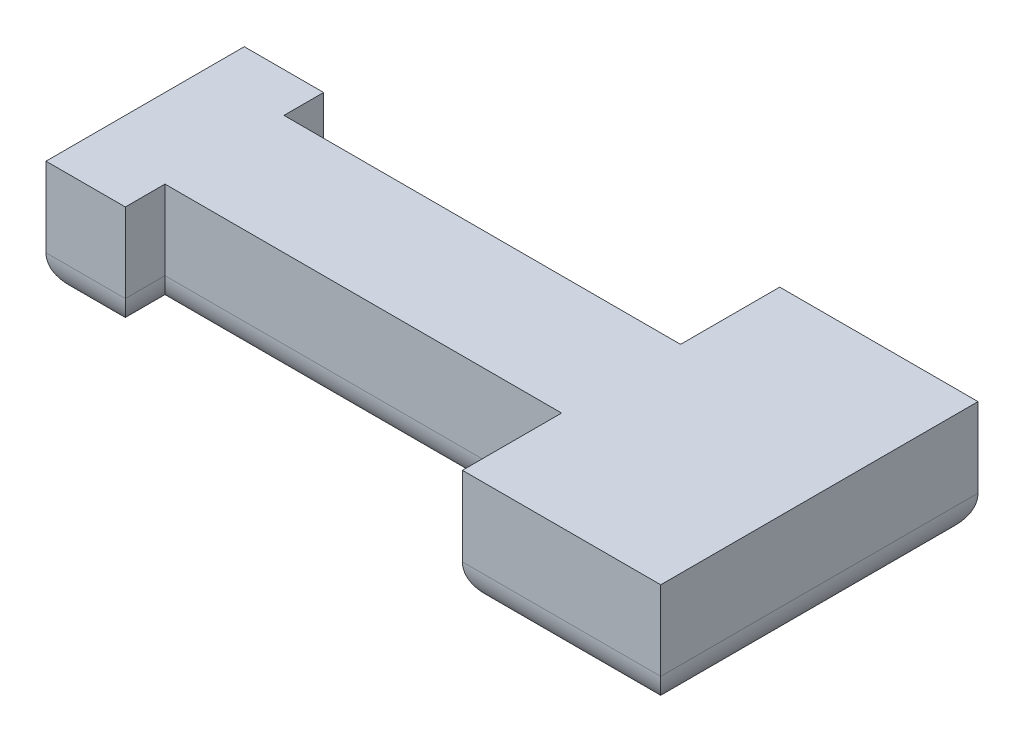
ISO-10303-21;
HEADER;
FILE_DESCRIPTION(('STEP AP214'),'2;1');
FILE_NAME('part.step','',(''),(''),'','','');
FILE_SCHEMA(('AUTOMOTIVE_DESIGN { 1 0 10303 214 1 1 1 1 }'));
ENDSEC;
DATA;
#1=APPLICATION_CONTEXT('core data for automotive mechanical design processes');
#2=APPLICATION_PROTOCOL_DEFINITION('international standard','automotive_design',2000,#1);
#3=PRODUCT_CONTEXT('',#1,'mechanical');
#4=PRODUCT('Part','Part','',(#3));
#5=PRODUCT_RELATED_PRODUCT_CATEGORY('part','',(#4));
#6=PRODUCT_DEFINITION_FORMATION('','',#4);
#7=PRODUCT_DEFINITION_CONTEXT('part definition',#1,'design');
#8=PRODUCT_DEFINITION('design','',#6,#7);
#9=PRODUCT_DEFINITION_SHAPE('','',#8);
#10=(LENGTH_UNIT() NAMED_UNIT(*) SI_UNIT(.MILLI.,.METRE.));
#11=(NAMED_UNIT(*) PLANE_ANGLE_UNIT() SI_UNIT($,.RADIAN.));
#12=(NAMED_UNIT(*) SI_UNIT($,.STERADIAN.) SOLID_ANGLE_UNIT());
#13=UNCERTAINTY_MEASURE_WITH_UNIT(LENGTH_MEASURE(1.E-05),#10,'distance_accuracy_value','');
#14=(GEOMETRIC_REPRESENTATION_CONTEXT(3) GLOBAL_UNCERTAINTY_ASSIGNED_CONTEXT((#13)) GLOBAL_UNIT_ASSIGNED_CONTEXT((#10,
#11,#12)) REPRESENTATION_CONTEXT('',''));
#15=CARTESIAN_POINT('',(0.,0.,0.));
#16=DIRECTION('',(0.,0.,1.));
#17=DIRECTION('',(1.,0.,0.));
#18=AXIS2_PLACEMENT_3D('',#15,#16,#17);
#19=CARTESIAN_POINT('',(2.5,3.,-4.));
#20=DIRECTION('',(-1.,0.,0.));
#21=DIRECTION('',(0.,0.,1.));
#22=AXIS2_PLACEMENT_3D('',#19,#20,#21);
#23=PLANE('',#22);
#24=DIRECTION('',(0.,-1.,0.));
#25=VECTOR('',#24,1.);
#26=CARTESIAN_POINT('',(2.5,3.,4.));
#27=LINE('',#26,#25);
#28=CARTESIAN_POINT('',(2.5,3.,4.));
#29=VERTEX_POINT('',#28);
#30=CARTESIAN_POINT('',(2.5,1.,4.));
#31=VERTEX_POINT('',#30);
#32=EDGE_CURVE('E261',#29,#31,#27,.T.);
#33=ORIENTED_EDGE('',*,*,#32,.T.);
#34=DIRECTION('',(0.,0.,-1.));
#35=VECTOR('',#34,1.);
#36=CARTESIAN_POINT('',(2.5,1.,-4.));
#37=LINE('',#36,#35);
#38=CARTESIAN_POINT('',(2.5,1.,-4.));
#39=VERTEX_POINT('',#38);
#40=EDGE_CURVE('E11',#31,#39,#37,.T.);
#41=ORIENTED_EDGE('',*,*,#40,.T.);
#42=DIRECTION('',(0.,-1.,0.));
#43=VECTOR('',#42,1.);
#44=CARTESIAN_POINT('',(2.5,3.,-4.));
#45=LINE('',#44,#43);
#46=CARTESIAN_POINT('',(2.5,3.,-4.));
#47=VERTEX_POINT('',#46);
#48=EDGE_CURVE('E286',#47,#39,#45,.T.);
#49=ORIENTED_EDGE('',*,*,#48,.F.);
#50=DIRECTION('',(0.,0.,-1.));
#51=VECTOR('',#50,1.);
#52=CARTESIAN_POINT('',(2.5,3.,-4.));
#53=LINE('',#52,#51);
#54=EDGE_CURVE('E235',#29,#47,#53,.T.);
#55=ORIENTED_EDGE('',*,*,#54,.F.);
#56=EDGE_LOOP('',(#33,#41,#49,#55));
#57=FACE_BOUND('',#56,.T.);
#58=ADVANCED_FACE('F36',(#57),#23,.F.);
#59=CARTESIAN_POINT('',(-2.5,3.,-4.));
#60=DIRECTION('',(0.,0.,1.));
#61=DIRECTION('',(1.,0.,0.));
#62=AXIS2_PLACEMENT_3D('',#59,#60,#61);
#63=PLANE('',#62);
#64=ORIENTED_EDGE('',*,*,#48,.T.);
#65=DIRECTION('',(-1.,0.,0.));
#66=VECTOR('',#65,1.);
#67=CARTESIAN_POINT('',(-2.5,1.,-4.));
#68=LINE('',#67,#66);
#69=CARTESIAN_POINT('',(-2.5,1.,-4.));
#70=VERTEX_POINT('',#69);
#71=EDGE_CURVE('E288',#39,#70,#68,.T.);
#72=ORIENTED_EDGE('',*,*,#71,.T.);
#73=DIRECTION('',(0.,-1.,0.));
#74=VECTOR('',#73,1.);
#75=CARTESIAN_POINT('',(-2.5,3.,-4.));
#76=LINE('',#75,#74);
#77=CARTESIAN_POINT('',(-2.5,3.,-4.));
#78=VERTEX_POINT('',#77);
#79=EDGE_CURVE('E283',#78,#70,#76,.T.);
#80=ORIENTED_EDGE('',*,*,#79,.F.);
#81=DIRECTION('',(-1.,0.,0.));
#82=VECTOR('',#81,1.);
#83=CARTESIAN_POINT('',(-2.5,3.,-4.));
#84=LINE('',#83,#82);
#85=EDGE_CURVE('E82',#47,#78,#84,.T.);
#86=ORIENTED_EDGE('',*,*,#85,.F.);
#87=EDGE_LOOP('',(#64,#72,#80,#86));
#88=FACE_BOUND('',#87,.T.);
#89=ADVANCED_FACE('F341',(#88),#63,.F.);
#90=CARTESIAN_POINT('',(-2.5,3.,-4.));
#91=DIRECTION('',(1.,0.,0.));
#92=DIRECTION('',(0.,0.,-1.));
#93=AXIS2_PLACEMENT_3D('',#90,#91,#92);
#94=PLANE('',#93);
#95=ORIENTED_EDGE('',*,*,#79,.T.);
#96=DIRECTION('',(0.,0.,1.));
#97=VECTOR('',#96,1.);
#98=CARTESIAN_POINT('',(-2.5,1.,-4.));
#99=LINE('',#98,#97);
#100=CARTESIAN_POINT('',(-2.5,1.,-1.5));
#101=VERTEX_POINT('',#100);
#102=EDGE_CURVE('E307',#70,#101,#99,.T.);
#103=ORIENTED_EDGE('',*,*,#102,.T.);
#104=DIRECTION('',(0.,-1.,0.));
#105=VECTOR('',#104,1.);
#106=CARTESIAN_POINT('',(-2.5,3.,-1.5));
#107=LINE('',#106,#105);
#108=CARTESIAN_POINT('',(-2.5,3.,-1.5));
#109=VERTEX_POINT('',#108);
#110=EDGE_CURVE('E280',#109,#101,#107,.T.);
#111=ORIENTED_EDGE('',*,*,#110,.F.);
#112=DIRECTION('',(0.,0.,1.));
#113=VECTOR('',#112,1.);
#114=CARTESIAN_POINT('',(-2.5,3.,-4.));
#115=LINE('',#114,#113);
#116=EDGE_CURVE('E240',#78,#109,#115,.T.);
#117=ORIENTED_EDGE('',*,*,#116,.F.);
#118=EDGE_LOOP('',(#95,#103,#111,#117));
#119=FACE_BOUND('',#118,.T.);
#120=ADVANCED_FACE('F345',(#119),#94,.F.);
#121=CARTESIAN_POINT('',(-2.5,3.,-1.5));
#122=DIRECTION('',(0.,0.,1.));
#123=DIRECTION('',(1.,0.,0.));
#124=AXIS2_PLACEMENT_3D('',#121,#122,#123);
#125=PLANE('',#124);
#126=ORIENTED_EDGE('',*,*,#110,.T.);
#127=DIRECTION('',(-1.,0.,0.));
#128=VECTOR('',#127,1.);
#129=CARTESIAN_POINT('',(-2.5,1.,-1.5));
#130=LINE('',#129,#128);
#131=CARTESIAN_POINT('',(-12.5,1.,-1.5));
#132=VERTEX_POINT('',#131);
#133=EDGE_CURVE('E309',#101,#132,#130,.T.);
#134=ORIENTED_EDGE('',*,*,#133,.T.);
#135=DIRECTION('',(0.,-1.,0.));
#136=VECTOR('',#135,1.);
#137=CARTESIAN_POINT('',(-12.5,3.,-1.5));
#138=LINE('',#137,#136);
#139=CARTESIAN_POINT('',(-12.5,3.,-1.5));
#140=VERTEX_POINT('',#139);
#141=EDGE_CURVE('E277',#140,#132,#138,.T.);
#142=ORIENTED_EDGE('',*,*,#141,.F.);
#143=DIRECTION('',(-1.,0.,0.));
#144=VECTOR('',#143,1.);
#145=CARTESIAN_POINT('',(-2.5,3.,-1.5));
#146=LINE('',#145,#144);
#147=EDGE_CURVE('E244',#109,#140,#146,.T.);
#148=ORIENTED_EDGE('',*,*,#147,.F.);
#149=EDGE_LOOP('',(#126,#134,#142,#148));
#150=FACE_BOUND('',#149,.T.);
#151=ADVANCED_FACE('F354',(#150),#125,.F.);
#152=CARTESIAN_POINT('',(-12.5,3.,-2.5));
#153=DIRECTION('',(-1.,0.,0.));
#154=DIRECTION('',(0.,0.,1.));
#155=AXIS2_PLACEMENT_3D('',#152,#153,#154);
#156=PLANE('',#155);
#157=ORIENTED_EDGE('',*,*,#141,.T.);
#158=DIRECTION('',(0.,0.,-1.));
#159=VECTOR('',#158,1.);
#160=CARTESIAN_POINT('',(-12.5,1.,-2.5));
#161=LINE('',#160,#159);
#162=CARTESIAN_POINT('',(-12.5,1.,-2.5));
#163=VERTEX_POINT('',#162);
#164=EDGE_CURVE('E311',#132,#163,#161,.T.);
#165=ORIENTED_EDGE('',*,*,#164,.T.);
#166=DIRECTION('',(0.,-1.,0.));
#167=VECTOR('',#166,1.);
#168=CARTESIAN_POINT('',(-12.5,3.,-2.5));
#169=LINE('',#168,#167);
#170=CARTESIAN_POINT('',(-12.5,3.,-2.5));
#171=VERTEX_POINT('',#170);
#172=EDGE_CURVE('E274',#171,#163,#169,.T.);
#173=ORIENTED_EDGE('',*,*,#172,.F.);
#174=DIRECTION('',(0.,0.,-1.));
#175=VECTOR('',#174,1.);
#176=CARTESIAN_POINT('',(-12.5,3.,-2.5));
#177=LINE('',#176,#175);
#178=EDGE_CURVE('E246',#140,#171,#177,.T.);
#179=ORIENTED_EDGE('',*,*,#178,.F.);
#180=EDGE_LOOP('',(#157,#165,#173,#179));
#181=FACE_BOUND('',#180,.T.);
#182=ADVANCED_FACE('F358',(#181),#156,.F.);
#183=CARTESIAN_POINT('',(-14.5,3.,-2.5));
#184=DIRECTION('',(0.,0.,1.));
#185=DIRECTION('',(1.,0.,0.));
#186=AXIS2_PLACEMENT_3D('',#183,#184,#185);
#187=PLANE('',#186);
#188=ORIENTED_EDGE('',*,*,#172,.T.);
#189=DIRECTION('',(-1.,0.,0.));
#190=VECTOR('',#189,1.);
#191=CARTESIAN_POINT('',(-14.5,1.,-2.5));
#192=LINE('',#191,#190);
#193=CARTESIAN_POINT('',(-14.5,1.,-2.5));
#194=VERTEX_POINT('',#193);
#195=EDGE_CURVE('E313',#163,#194,#192,.T.);
#196=ORIENTED_EDGE('',*,*,#195,.T.);
#197=DIRECTION('',(0.,-1.,0.));
#198=VECTOR('',#197,1.);
#199=CARTESIAN_POINT('',(-14.5,3.,-2.5));
#200=LINE('',#199,#198);
#201=CARTESIAN_POINT('',(-14.5,3.,-2.5));
#202=VERTEX_POINT('',#201);
#203=EDGE_CURVE('E271',#202,#194,#200,.T.);
#204=ORIENTED_EDGE('',*,*,#203,.F.);
#205=DIRECTION('',(-1.,0.,0.));
#206=VECTOR('',#205,1.);
#207=CARTESIAN_POINT('',(-14.5,3.,-2.5));
#208=LINE('',#207,#206);
#209=EDGE_CURVE('E248',#171,#202,#208,.T.);
#210=ORIENTED_EDGE('',*,*,#209,.F.);
#211=EDGE_LOOP('',(#188,#196,#204,#210));
#212=FACE_BOUND('',#211,.T.);
#213=ADVANCED_FACE('F363',(#212),#187,.F.);
#214=CARTESIAN_POINT('',(-14.5,3.,-2.5));
#215=DIRECTION('',(1.,0.,0.));
#216=DIRECTION('',(0.,0.,-1.));
#217=AXIS2_PLACEMENT_3D('',#214,#215,#216);
#218=PLANE('',#217);
#219=ORIENTED_EDGE('',*,*,#203,.T.);
#220=DIRECTION('',(0.,0.,1.));
#221=VECTOR('',#220,1.);
#222=CARTESIAN_POINT('',(-14.5,1.,-2.5));
#223=LINE('',#222,#221);
#224=CARTESIAN_POINT('',(-14.5,1.,2.5));
#225=VERTEX_POINT('',#224);
#226=EDGE_CURVE('E315',#194,#225,#223,.T.);
#227=ORIENTED_EDGE('',*,*,#226,.T.);
#228=DIRECTION('',(0.,-1.,0.));
#229=VECTOR('',#228,1.);
#230=CARTESIAN_POINT('',(-14.5,3.,2.5));
#231=LINE('',#230,#229);
#232=CARTESIAN_POINT('',(-14.5,3.,2.5));
#233=VERTEX_POINT('',#232);
#234=EDGE_CURVE('E268',#233,#225,#231,.T.);
#235=ORIENTED_EDGE('',*,*,#234,.F.);
#236=DIRECTION('',(0.,0.,1.));
#237=VECTOR('',#236,1.);
#238=CARTESIAN_POINT('',(-14.5,3.,-2.5));
#239=LINE('',#238,#237);
#240=EDGE_CURVE('E250',#202,#233,#239,.T.);
#241=ORIENTED_EDGE('',*,*,#240,.F.);
#242=EDGE_LOOP('',(#219,#227,#235,#241));
#243=FACE_BOUND('',#242,.T.);
#244=ADVANCED_FACE('F368',(#243),#218,.F.);
#245=CARTESIAN_POINT('',(-14.5,3.,2.5));
#246=DIRECTION('',(0.,0.,-1.));
#247=DIRECTION('',(-1.,0.,0.));
#248=AXIS2_PLACEMENT_3D('',#245,#246,#247);
#249=PLANE('',#248);
#250=ORIENTED_EDGE('',*,*,#234,.T.);
#251=DIRECTION('',(1.,0.,0.));
#252=VECTOR('',#251,1.);
#253=CARTESIAN_POINT('',(-14.5,1.,2.5));
#254=LINE('',#253,#252);
#255=CARTESIAN_POINT('',(-12.5,1.,2.5));
#256=VERTEX_POINT('',#255);
#257=EDGE_CURVE('E317',#225,#256,#254,.T.);
#258=ORIENTED_EDGE('',*,*,#257,.T.);
#259=DIRECTION('',(0.,-1.,0.));
#260=VECTOR('',#259,1.);
#261=CARTESIAN_POINT('',(-12.5,3.,2.5));
#262=LINE('',#261,#260);
#263=CARTESIAN_POINT('',(-12.5,3.,2.5));
#264=VERTEX_POINT('',#263);
#265=EDGE_CURVE('E265',#264,#256,#262,.T.);
#266=ORIENTED_EDGE('',*,*,#265,.F.);
#267=DIRECTION('',(1.,0.,0.));
#268=VECTOR('',#267,1.);
#269=CARTESIAN_POINT('',(-14.5,3.,2.5));
#270=LINE('',#269,#268);
#271=EDGE_CURVE('E252',#233,#264,#270,.T.);
#272=ORIENTED_EDGE('',*,*,#271,.F.);
#273=EDGE_LOOP('',(#250,#258,#266,#272));
#274=FACE_BOUND('',#273,.T.);
#275=ADVANCED_FACE('F371',(#274),#249,.F.);
#276=CARTESIAN_POINT('',(-12.5,3.,1.5));
#277=DIRECTION('',(-1.,0.,0.));
#278=DIRECTION('',(0.,0.,1.));
#279=AXIS2_PLACEMENT_3D('',#276,#277,#278);
#280=PLANE('',#279);
#281=ORIENTED_EDGE('',*,*,#265,.T.);
#282=DIRECTION('',(0.,0.,-1.));
#283=VECTOR('',#282,1.);
#284=CARTESIAN_POINT('',(-12.5,1.,1.5));
#285=LINE('',#284,#283);
#286=CARTESIAN_POINT('',(-12.5,1.,1.5));
#287=VERTEX_POINT('',#286);
#288=EDGE_CURVE('E183',#256,#287,#285,.T.);
#289=ORIENTED_EDGE('',*,*,#288,.T.);
#290=DIRECTION('',(0.,-1.,0.));
#291=VECTOR('',#290,1.);
#292=CARTESIAN_POINT('',(-12.5,3.,1.5));
#293=LINE('',#292,#291);
#294=CARTESIAN_POINT('',(-12.5,3.,1.5));
#295=VERTEX_POINT('',#294);
#296=EDGE_CURVE('E177',#295,#287,#293,.T.);
#297=ORIENTED_EDGE('',*,*,#296,.F.);
#298=DIRECTION('',(0.,0.,-1.));
#299=VECTOR('',#298,1.);
#300=CARTESIAN_POINT('',(-12.5,3.,1.5));
#301=LINE('',#300,#299);
#302=EDGE_CURVE('E254',#264,#295,#301,.T.);
#303=ORIENTED_EDGE('',*,*,#302,.F.);
#304=EDGE_LOOP('',(#281,#289,#297,#303));
#305=FACE_BOUND('',#304,.T.);
#306=ADVANCED_FACE('F319',(#305),#280,.F.);
#307=CARTESIAN_POINT('',(-2.5,3.,1.5));
#308=DIRECTION('',(0.,0.,-1.));
#309=DIRECTION('',(-1.,0.,0.));
#310=AXIS2_PLACEMENT_3D('',#307,#308,#309);
#311=PLANE('',#310);
#312=ORIENTED_EDGE('',*,*,#296,.T.);
#313=DIRECTION('',(1.,0.,0.));
#314=VECTOR('',#313,1.);
#315=CARTESIAN_POINT('',(-2.5,1.,1.5));
#316=LINE('',#315,#314);
#317=CARTESIAN_POINT('',(-2.5,1.,1.5));
#318=VERTEX_POINT('',#317);
#319=EDGE_CURVE('E170',#287,#318,#316,.T.);
#320=ORIENTED_EDGE('',*,*,#319,.T.);
#321=DIRECTION('',(0.,-1.,0.));
#322=VECTOR('',#321,1.);
#323=CARTESIAN_POINT('',(-2.5,3.,1.5));
#324=LINE('',#323,#322);
#325=CARTESIAN_POINT('',(-2.5,3.,1.5));
#326=VERTEX_POINT('',#325);
#327=EDGE_CURVE('E174',#326,#318,#324,.T.);
#328=ORIENTED_EDGE('',*,*,#327,.F.);
#329=DIRECTION('',(1.,0.,0.));
#330=VECTOR('',#329,1.);
#331=CARTESIAN_POINT('',(-2.5,3.,1.5));
#332=LINE('',#331,#330);
#333=EDGE_CURVE('E256',#295,#326,#332,.T.);
#334=ORIENTED_EDGE('',*,*,#333,.F.);
#335=EDGE_LOOP('',(#312,#320,#328,#334));
#336=FACE_BOUND('',#335,.T.);
#337=ADVANCED_FACE('F172',(#336),#311,.F.);
#338=CARTESIAN_POINT('',(-2.5,3.,1.5));
#339=DIRECTION('',(1.,0.,0.));
#340=DIRECTION('',(0.,0.,-1.));
#341=AXIS2_PLACEMENT_3D('',#338,#339,#340);
#342=PLANE('',#341);
#343=ORIENTED_EDGE('',*,*,#327,.T.);
#344=DIRECTION('',(0.,0.,1.));
#345=VECTOR('',#344,1.);
#346=CARTESIAN_POINT('',(-2.5,1.,1.5));
#347=LINE('',#346,#345);
#348=CARTESIAN_POINT('',(-2.5,1.,4.));
#349=VERTEX_POINT('',#348);
#350=EDGE_CURVE('E182',#318,#349,#347,.T.);
#351=ORIENTED_EDGE('',*,*,#350,.T.);
#352=DIRECTION('',(0.,-1.,0.));
#353=VECTOR('',#352,1.);
#354=CARTESIAN_POINT('',(-2.5,3.,4.));
#355=LINE('',#354,#353);
#356=CARTESIAN_POINT('',(-2.5,3.,4.));
#357=VERTEX_POINT('',#356);
#358=EDGE_CURVE('E190',#357,#349,#355,.T.);
#359=ORIENTED_EDGE('',*,*,#358,.F.);
#360=DIRECTION('',(0.,0.,1.));
#361=VECTOR('',#360,1.);
#362=CARTESIAN_POINT('',(-2.5,3.,1.5));
#363=LINE('',#362,#361);
#364=EDGE_CURVE('E189',#326,#357,#363,.T.);
#365=ORIENTED_EDGE('',*,*,#364,.F.);
#366=EDGE_LOOP('',(#343,#351,#359,#365));
#367=FACE_BOUND('',#366,.T.);
#368=ADVANCED_FACE('F186',(#367),#342,.F.);
#369=CARTESIAN_POINT('',(-2.5,3.,4.));
#370=DIRECTION('',(0.,0.,-1.));
#371=DIRECTION('',(-1.,0.,0.));
#372=AXIS2_PLACEMENT_3D('',#369,#370,#371);
#373=PLANE('',#372);
#374=ORIENTED_EDGE('',*,*,#358,.T.);
#375=DIRECTION('',(1.,0.,0.));
#376=VECTOR('',#375,1.);
#377=CARTESIAN_POINT('',(-2.5,1.,4.));
#378=LINE('',#377,#376);
#379=EDGE_CURVE('E46',#349,#31,#378,.T.);
#380=ORIENTED_EDGE('',*,*,#379,.T.);
#381=ORIENTED_EDGE('',*,*,#32,.F.);
#382=DIRECTION('',(1.,0.,0.));
#383=VECTOR('',#382,1.);
#384=CARTESIAN_POINT('',(-2.5,3.,4.));
#385=LINE('',#384,#383);
#386=EDGE_CURVE('E259',#357,#29,#385,.T.);
#387=ORIENTED_EDGE('',*,*,#386,.F.);
#388=EDGE_LOOP('',(#374,#380,#381,#387));
#389=FACE_BOUND('',#388,.T.);
#390=ADVANCED_FACE('F373',(#389),#373,.F.);
#391=CARTESIAN_POINT('',(0.,3.,0.));
#392=DIRECTION('',(0.,1.,0.));
#393=DIRECTION('',(0.,0.,1.));
#394=AXIS2_PLACEMENT_3D('',#391,#392,#393);
#395=PLANE('',#394);
#396=ORIENTED_EDGE('',*,*,#54,.T.);
#397=ORIENTED_EDGE('',*,*,#85,.T.);
#398=ORIENTED_EDGE('',*,*,#116,.T.);
#399=ORIENTED_EDGE('',*,*,#147,.T.);
#400=ORIENTED_EDGE('',*,*,#178,.T.);
#401=ORIENTED_EDGE('',*,*,#209,.T.);
#402=ORIENTED_EDGE('',*,*,#240,.T.);
#403=ORIENTED_EDGE('',*,*,#271,.T.);
#404=ORIENTED_EDGE('',*,*,#302,.T.);
#405=ORIENTED_EDGE('',*,*,#333,.T.);
#406=ORIENTED_EDGE('',*,*,#364,.T.);
#407=ORIENTED_EDGE('',*,*,#386,.T.);
#408=EDGE_LOOP('',(#396,#397,#398,#399,#400,#401,#402,#403,#404,#405,#406,#407));
#409=FACE_BOUND('',#408,.T.);
#410=ADVANCED_FACE('F349',(#409),#395,.T.);
#411=CARTESIAN_POINT('',(0.,0.,0.));
#412=DIRECTION('',(0.,1.,0.));
#413=DIRECTION('',(0.,0.,1.));
#414=AXIS2_PLACEMENT_3D('',#411,#412,#413);
#415=PLANE('',#414);
#416=DIRECTION('',(0.,0.,1.));
#417=VECTOR('',#416,1.);
#418=CARTESIAN_POINT('',(-1.5,0.,0.));
#419=LINE('',#418,#417);
#420=CARTESIAN_POINT('',(-1.5,0.,-0.500000000000001));
#421=VERTEX_POINT('',#420);
#422=CARTESIAN_POINT('',(-1.5,0.,-3.));
#423=VERTEX_POINT('',#422);
#424=EDGE_CURVE('E302',#421,#423,#419,.F.);
#425=ORIENTED_EDGE('',*,*,#424,.T.);
#426=DIRECTION('',(-1.,0.,0.));
#427=VECTOR('',#426,1.);
#428=CARTESIAN_POINT('',(0.,0.,-3.));
#429=LINE('',#428,#427);
#430=CARTESIAN_POINT('',(1.5,0.,-3.));
#431=VERTEX_POINT('',#430);
#432=EDGE_CURVE('E304',#423,#431,#429,.F.);
#433=ORIENTED_EDGE('',*,*,#432,.T.);
#434=DIRECTION('',(0.,0.,-1.));
#435=VECTOR('',#434,1.);
#436=CARTESIAN_POINT('',(1.5,0.,0.));
#437=LINE('',#436,#435);
#438=CARTESIAN_POINT('',(1.5,0.,3.));
#439=VERTEX_POINT('',#438);
#440=EDGE_CURVE('E291',#431,#439,#437,.F.);
#441=ORIENTED_EDGE('',*,*,#440,.T.);
#442=DIRECTION('',(1.,0.,0.));
#443=VECTOR('',#442,1.);
#444=CARTESIAN_POINT('',(0.,0.,3.));
#445=LINE('',#444,#443);
#446=CARTESIAN_POINT('',(-1.5,0.,3.));
#447=VERTEX_POINT('',#446);
#448=EDGE_CURVE('E293',#439,#447,#445,.F.);
#449=ORIENTED_EDGE('',*,*,#448,.T.);
#450=DIRECTION('',(0.,0.,1.));
#451=VECTOR('',#450,1.);
#452=CARTESIAN_POINT('',(-1.5,0.,0.));
#453=LINE('',#452,#451);
#454=CARTESIAN_POINT('',(-1.5,0.,0.499999999999999));
#455=VERTEX_POINT('',#454);
#456=EDGE_CURVE('E295',#447,#455,#453,.F.);
#457=ORIENTED_EDGE('',*,*,#456,.T.);
#458=DIRECTION('',(1.,0.,0.));
#459=VECTOR('',#458,1.);
#460=CARTESIAN_POINT('',(0.,0.,0.499999999999999));
#461=LINE('',#460,#459);
#462=CARTESIAN_POINT('',(-13.5,0.,0.500000000000001));
#463=VERTEX_POINT('',#462);
#464=EDGE_CURVE('E196',#455,#463,#461,.F.);
#465=ORIENTED_EDGE('',*,*,#464,.T.);
#466=DIRECTION('',(0.,0.,1.));
#467=VECTOR('',#466,1.);
#468=CARTESIAN_POINT('',(-13.5,0.,0.));
#469=LINE('',#468,#467);
#470=CARTESIAN_POINT('',(-13.5,0.,-0.5));
#471=VERTEX_POINT('',#470);
#472=EDGE_CURVE('E298',#463,#471,#469,.F.);
#473=ORIENTED_EDGE('',*,*,#472,.T.);
#474=DIRECTION('',(-1.,0.,0.));
#475=VECTOR('',#474,1.);
#476=CARTESIAN_POINT('',(0.,0.,-0.500000000000001));
#477=LINE('',#476,#475);
#478=EDGE_CURVE('E300',#471,#421,#477,.F.);
#479=ORIENTED_EDGE('',*,*,#478,.T.);
#480=EDGE_LOOP('',(#425,#433,#441,#449,#457,#465,#473,#479));
#481=FACE_BOUND('',#480,.T.);
#482=ADVANCED_FACE('F327',(#481),#415,.F.);
#483=CARTESIAN_POINT('',(-14.5,1.,1.5));
#484=DIRECTION('',(1.,0.,0.));
#485=DIRECTION('',(0.,0.,-1.));
#486=AXIS2_PLACEMENT_3D('',#483,#484,#485);
#487=CYLINDRICAL_SURFACE('',#486,1.);
#488=CARTESIAN_POINT('',(-13.5,1.,1.5));
#489=DIRECTION('',(0.707106781186547,0.,-0.707106781186547));
#490=DIRECTION('',(-0.707106781186547,0.,-0.707106781186547));
#491=AXIS2_PLACEMENT_3D('',#488,#489,#490);
#492=ELLIPSE('',#491,1.41421356237309,1.);
#493=CARTESIAN_POINT('',(-13.5,0.,1.5));
#494=VERTEX_POINT('',#493);
#495=EDGE_CURVE('E40',#256,#494,#492,.T.);
#496=ORIENTED_EDGE('',*,*,#495,.F.);
#497=ORIENTED_EDGE('',*,*,#257,.F.);
#498=CARTESIAN_POINT('',(-13.5,1.,1.5));
#499=DIRECTION('',(0.707106781186548,0.,0.707106781186547));
#500=DIRECTION('',(0.707106781186547,0.,-0.707106781186548));
#501=AXIS2_PLACEMENT_3D('',#498,#499,#500);
#502=ELLIPSE('',#501,1.41421356237309,1.);
#503=EDGE_CURVE('E231',#494,#225,#502,.F.);
#504=ORIENTED_EDGE('',*,*,#503,.F.);
#505=EDGE_LOOP('',(#496,#497,#504));
#506=FACE_BOUND('',#505,.T.);
#507=ADVANCED_FACE('F38',(#506),#487,.T.);
#508=CARTESIAN_POINT('',(-13.5,1.,1.5));
#509=DIRECTION('',(0.,0.,-1.));
#510=DIRECTION('',(-1.,0.,0.));
#511=AXIS2_PLACEMENT_3D('',#508,#509,#510);
#512=CYLINDRICAL_SURFACE('',#511,1.);
#513=DIRECTION('',(0.,0.,-1.));
#514=VECTOR('',#513,1.);
#515=CARTESIAN_POINT('',(-13.5,0.,0.));
#516=LINE('',#515,#514);
#517=EDGE_CURVE('E199',#463,#494,#516,.F.);
#518=ORIENTED_EDGE('',*,*,#517,.F.);
#519=CARTESIAN_POINT('',(-13.5,1.,0.500000000000001));
#520=DIRECTION('',(0.707106781186547,0.,-0.707106781186548));
#521=DIRECTION('',(-0.707106781186548,0.,-0.707106781186547));
#522=AXIS2_PLACEMENT_3D('',#519,#520,#521);
#523=ELLIPSE('',#522,1.41421356237309,1.);
#524=EDGE_CURVE('E234',#287,#463,#523,.T.);
#525=ORIENTED_EDGE('',*,*,#524,.F.);
#526=ORIENTED_EDGE('',*,*,#288,.F.);
#527=ORIENTED_EDGE('',*,*,#495,.T.);
#528=EDGE_LOOP('',(#518,#525,#526,#527));
#529=FACE_BOUND('',#528,.T.);
#530=ADVANCED_FACE('F322',(#529),#512,.T.);
#531=CARTESIAN_POINT('',(-2.5,1.,0.499999999999999));
#532=DIRECTION('',(1.,0.,0.));
#533=DIRECTION('',(0.,0.,-1.));
#534=AXIS2_PLACEMENT_3D('',#531,#532,#533);
#535=CYLINDRICAL_SURFACE('',#534,1.);
#536=ORIENTED_EDGE('',*,*,#524,.T.);
#537=ORIENTED_EDGE('',*,*,#464,.F.);
#538=CARTESIAN_POINT('',(-1.5,1.,0.499999999999999));
#539=DIRECTION('',(0.707106781186548,0.,0.707106781186547));
#540=DIRECTION('',(0.707106781186547,0.,-0.707106781186548));
#541=AXIS2_PLACEMENT_3D('',#538,#539,#540);
#542=ELLIPSE('',#541,1.41421356237309,1.);
#543=EDGE_CURVE('E194',#318,#455,#542,.T.);
#544=ORIENTED_EDGE('',*,*,#543,.F.);
#545=ORIENTED_EDGE('',*,*,#319,.F.);
#546=EDGE_LOOP('',(#536,#537,#544,#545));
#547=FACE_BOUND('',#546,.T.);
#548=ADVANCED_FACE('F195',(#547),#535,.T.);
#549=CARTESIAN_POINT('',(-14.5,1.,-1.5));
#550=DIRECTION('',(-1.,0.,0.));
#551=DIRECTION('',(0.,0.,1.));
#552=AXIS2_PLACEMENT_3D('',#549,#550,#551);
#553=CYLINDRICAL_SURFACE('',#552,1.);
#554=CARTESIAN_POINT('',(-13.5,1.,-1.5));
#555=DIRECTION('',(-0.707106781186547,0.,0.707106781186548));
#556=DIRECTION('',(0.707106781186548,0.,0.707106781186547));
#557=AXIS2_PLACEMENT_3D('',#554,#555,#556);
#558=ELLIPSE('',#557,1.4142135623731,1.);
#559=CARTESIAN_POINT('',(-13.5,0.,-1.5));
#560=VERTEX_POINT('',#559);
#561=EDGE_CURVE('E66',#194,#560,#558,.T.);
#562=ORIENTED_EDGE('',*,*,#561,.F.);
#563=ORIENTED_EDGE('',*,*,#195,.F.);
#564=CARTESIAN_POINT('',(-13.5,1.,-1.5));
#565=DIRECTION('',(-0.707106781186547,0.,-0.707106781186548));
#566=DIRECTION('',(-0.707106781186548,0.,0.707106781186547));
#567=AXIS2_PLACEMENT_3D('',#564,#565,#566);
#568=ELLIPSE('',#567,1.4142135623731,1.);
#569=EDGE_CURVE('E200',#560,#163,#568,.F.);
#570=ORIENTED_EDGE('',*,*,#569,.F.);
#571=EDGE_LOOP('',(#562,#563,#570));
#572=FACE_BOUND('',#571,.T.);
#573=ADVANCED_FACE('F414',(#572),#553,.T.);
#574=CARTESIAN_POINT('',(-13.5,1.,-2.5));
#575=DIRECTION('',(0.,0.,1.));
#576=DIRECTION('',(1.,0.,0.));
#577=AXIS2_PLACEMENT_3D('',#574,#575,#576);
#578=CYLINDRICAL_SURFACE('',#577,1.);
#579=ORIENTED_EDGE('',*,*,#226,.F.);
#580=ORIENTED_EDGE('',*,*,#561,.T.);
#581=DIRECTION('',(0.,0.,1.));
#582=VECTOR('',#581,1.);
#583=CARTESIAN_POINT('',(-13.5,0.,0.));
#584=LINE('',#583,#582);
#585=EDGE_CURVE('E224',#471,#560,#584,.F.);
#586=ORIENTED_EDGE('',*,*,#585,.F.);
#587=ORIENTED_EDGE('',*,*,#472,.F.);
#588=ORIENTED_EDGE('',*,*,#517,.T.);
#589=ORIENTED_EDGE('',*,*,#503,.T.);
#590=EDGE_LOOP('',(#579,#580,#586,#587,#588,#589));
#591=FACE_BOUND('',#590,.T.);
#592=ADVANCED_FACE('F324',(#591),#578,.T.);
#593=CARTESIAN_POINT('',(-1.5,1.,1.5));
#594=DIRECTION('',(0.,0.,1.));
#595=DIRECTION('',(1.,0.,0.));
#596=AXIS2_PLACEMENT_3D('',#593,#594,#595);
#597=CYLINDRICAL_SURFACE('',#596,1.);
#598=ORIENTED_EDGE('',*,*,#543,.T.);
#599=ORIENTED_EDGE('',*,*,#456,.F.);
#600=CARTESIAN_POINT('',(-1.5,1.,3.));
#601=DIRECTION('',(0.707106781186548,0.,0.707106781186547));
#602=DIRECTION('',(0.707106781186547,0.,-0.707106781186548));
#603=AXIS2_PLACEMENT_3D('',#600,#601,#602);
#604=ELLIPSE('',#603,1.41421356237309,1.);
#605=EDGE_CURVE('E205',#349,#447,#604,.T.);
#606=ORIENTED_EDGE('',*,*,#605,.F.);
#607=ORIENTED_EDGE('',*,*,#350,.F.);
#608=EDGE_LOOP('',(#598,#599,#606,#607));
#609=FACE_BOUND('',#608,.T.);
#610=ADVANCED_FACE('F203',(#609),#597,.T.);
#611=CARTESIAN_POINT('',(-13.5,1.,-2.5));
#612=DIRECTION('',(0.,0.,-1.));
#613=DIRECTION('',(-1.,0.,0.));
#614=AXIS2_PLACEMENT_3D('',#611,#612,#613);
#615=CYLINDRICAL_SURFACE('',#614,1.);
#616=ORIENTED_EDGE('',*,*,#569,.T.);
#617=ORIENTED_EDGE('',*,*,#164,.F.);
#618=CARTESIAN_POINT('',(-13.5,1.,-0.5));
#619=DIRECTION('',(-0.707106781186547,0.,-0.707106781186548));
#620=DIRECTION('',(-0.707106781186548,0.,0.707106781186547));
#621=AXIS2_PLACEMENT_3D('',#618,#619,#620);
#622=ELLIPSE('',#621,1.4142135623731,1.);
#623=EDGE_CURVE('E220',#471,#132,#622,.F.);
#624=ORIENTED_EDGE('',*,*,#623,.F.);
#625=ORIENTED_EDGE('',*,*,#585,.T.);
#626=EDGE_LOOP('',(#616,#617,#624,#625));
#627=FACE_BOUND('',#626,.T.);
#628=ADVANCED_FACE('F406',(#627),#615,.T.);
#629=CARTESIAN_POINT('',(-2.5,1.,3.));
#630=DIRECTION('',(1.,0.,0.));
#631=DIRECTION('',(0.,0.,-1.));
#632=AXIS2_PLACEMENT_3D('',#629,#630,#631);
#633=CYLINDRICAL_SURFACE('',#632,1.);
#634=ORIENTED_EDGE('',*,*,#605,.T.);
#635=ORIENTED_EDGE('',*,*,#448,.F.);
#636=CARTESIAN_POINT('',(1.5,1.,3.));
#637=DIRECTION('',(0.707106781186547,0.,-0.707106781186548));
#638=DIRECTION('',(-0.707106781186547,0.,-0.707106781186547));
#639=AXIS2_PLACEMENT_3D('',#636,#637,#638);
#640=ELLIPSE('',#639,1.4142135623731,1.);
#641=EDGE_CURVE('E217',#31,#439,#640,.T.);
#642=ORIENTED_EDGE('',*,*,#641,.F.);
#643=ORIENTED_EDGE('',*,*,#379,.F.);
#644=EDGE_LOOP('',(#634,#635,#642,#643));
#645=FACE_BOUND('',#644,.T.);
#646=ADVANCED_FACE('F332',(#645),#633,.T.);
#647=CARTESIAN_POINT('',(-2.5,1.,-0.500000000000001));
#648=DIRECTION('',(-1.,0.,0.));
#649=DIRECTION('',(0.,0.,1.));
#650=AXIS2_PLACEMENT_3D('',#647,#648,#649);
#651=CYLINDRICAL_SURFACE('',#650,1.);
#652=ORIENTED_EDGE('',*,*,#623,.T.);
#653=ORIENTED_EDGE('',*,*,#133,.F.);
#654=CARTESIAN_POINT('',(-1.5,1.,-0.500000000000001));
#655=DIRECTION('',(-0.707106781186547,0.,0.707106781186548));
#656=DIRECTION('',(0.707106781186548,0.,0.707106781186547));
#657=AXIS2_PLACEMENT_3D('',#654,#655,#656);
#658=ELLIPSE('',#657,1.41421356237309,1.);
#659=EDGE_CURVE('E214',#421,#101,#658,.F.);
#660=ORIENTED_EDGE('',*,*,#659,.F.);
#661=ORIENTED_EDGE('',*,*,#478,.F.);
#662=EDGE_LOOP('',(#652,#653,#660,#661));
#663=FACE_BOUND('',#662,.T.);
#664=ADVANCED_FACE('F400',(#663),#651,.T.);
#665=CARTESIAN_POINT('',(1.5,1.,-4.));
#666=DIRECTION('',(0.,0.,-1.));
#667=DIRECTION('',(-1.,0.,0.));
#668=AXIS2_PLACEMENT_3D('',#665,#666,#667);
#669=CYLINDRICAL_SURFACE('',#668,1.);
#670=ORIENTED_EDGE('',*,*,#641,.T.);
#671=ORIENTED_EDGE('',*,*,#440,.F.);
#672=CARTESIAN_POINT('',(1.5,1.,-3.));
#673=DIRECTION('',(-0.707106781186547,0.,-0.707106781186547));
#674=DIRECTION('',(0.707106781186547,0.,-0.707106781186548));
#675=AXIS2_PLACEMENT_3D('',#672,#673,#674);
#676=ELLIPSE('',#675,1.41421356237309,1.);
#677=EDGE_CURVE('E212',#39,#431,#676,.T.);
#678=ORIENTED_EDGE('',*,*,#677,.F.);
#679=ORIENTED_EDGE('',*,*,#40,.F.);
#680=EDGE_LOOP('',(#670,#671,#678,#679));
#681=FACE_BOUND('',#680,.T.);
#682=ADVANCED_FACE('F338',(#681),#669,.T.);
#683=CARTESIAN_POINT('',(-1.5,1.,-4.));
#684=DIRECTION('',(0.,0.,1.));
#685=DIRECTION('',(1.,0.,0.));
#686=AXIS2_PLACEMENT_3D('',#683,#684,#685);
#687=CYLINDRICAL_SURFACE('',#686,1.);
#688=ORIENTED_EDGE('',*,*,#659,.T.);
#689=ORIENTED_EDGE('',*,*,#102,.F.);
#690=CARTESIAN_POINT('',(-1.5,1.,-3.));
#691=DIRECTION('',(-0.707106781186547,0.,0.707106781186547));
#692=DIRECTION('',(0.707106781186547,0.,0.707106781186547));
#693=AXIS2_PLACEMENT_3D('',#690,#691,#692);
#694=ELLIPSE('',#693,1.41421356237309,1.);
#695=EDGE_CURVE('E210',#423,#70,#694,.F.);
#696=ORIENTED_EDGE('',*,*,#695,.F.);
#697=ORIENTED_EDGE('',*,*,#424,.F.);
#698=EDGE_LOOP('',(#688,#689,#696,#697));
#699=FACE_BOUND('',#698,.T.);
#700=ADVANCED_FACE('F394',(#699),#687,.T.);
#701=CARTESIAN_POINT('',(-2.5,1.,-3.));
#702=DIRECTION('',(-1.,0.,0.));
#703=DIRECTION('',(0.,0.,1.));
#704=AXIS2_PLACEMENT_3D('',#701,#702,#703);
#705=CYLINDRICAL_SURFACE('',#704,1.);
#706=ORIENTED_EDGE('',*,*,#677,.T.);
#707=ORIENTED_EDGE('',*,*,#432,.F.);
#708=ORIENTED_EDGE('',*,*,#695,.T.);
#709=ORIENTED_EDGE('',*,*,#71,.F.);
#710=EDGE_LOOP('',(#706,#707,#708,#709));
#711=FACE_BOUND('',#710,.T.);
#712=ADVANCED_FACE('F391',(#711),#705,.T.);
#713=CLOSED_SHELL('',(#58,#89,#120,#151,#182,#213,#244,#275,#306,#337,#368,#390,#410,#482,#507,
#530,#548,#573,#592,#610,#628,#646,#664,#682,#700,#712));
#714=MANIFOLD_SOLID_BREP('B2',#713);
#715=ADVANCED_BREP_SHAPE_REPRESENTATION('',(#18,#714),#14);
#716=SHAPE_DEFINITION_REPRESENTATION(#9,#715);
ENDSEC;
END-ISO-10303-21;
